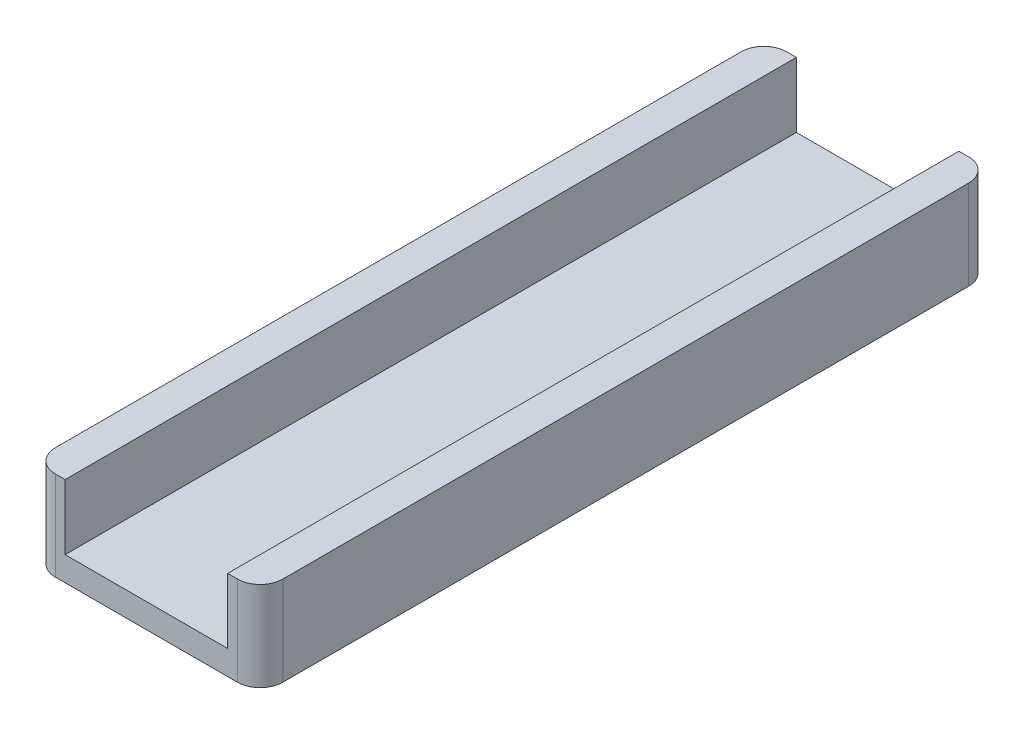
ISO-10303-21;
HEADER;
FILE_DESCRIPTION(('STEP AP214'),'2;1');
FILE_NAME('part.step','',(''),(''),'','','');
FILE_SCHEMA(('AUTOMOTIVE_DESIGN { 1 0 10303 214 1 1 1 1 }'));
ENDSEC;
DATA;
#1=APPLICATION_CONTEXT('core data for automotive mechanical design processes');
#2=APPLICATION_PROTOCOL_DEFINITION('international standard','automotive_design',2000,#1);
#3=PRODUCT_CONTEXT('',#1,'mechanical');
#4=PRODUCT('Part','Part','',(#3));
#5=PRODUCT_RELATED_PRODUCT_CATEGORY('part','',(#4));
#6=PRODUCT_DEFINITION_FORMATION('','',#4);
#7=PRODUCT_DEFINITION_CONTEXT('part definition',#1,'design');
#8=PRODUCT_DEFINITION('design','',#6,#7);
#9=PRODUCT_DEFINITION_SHAPE('','',#8);
#10=(LENGTH_UNIT() NAMED_UNIT(*) SI_UNIT(.MILLI.,.METRE.));
#11=(NAMED_UNIT(*) PLANE_ANGLE_UNIT() SI_UNIT($,.RADIAN.));
#12=(NAMED_UNIT(*) SI_UNIT($,.STERADIAN.) SOLID_ANGLE_UNIT());
#13=UNCERTAINTY_MEASURE_WITH_UNIT(LENGTH_MEASURE(1.E-05),#10,'distance_accuracy_value','');
#14=(GEOMETRIC_REPRESENTATION_CONTEXT(3) GLOBAL_UNCERTAINTY_ASSIGNED_CONTEXT((#13)) GLOBAL_UNIT_ASSIGNED_CONTEXT((#10,
#11,#12)) REPRESENTATION_CONTEXT('',''));
#15=CARTESIAN_POINT('',(0.,0.,0.));
#16=DIRECTION('',(0.,0.,1.));
#17=DIRECTION('',(1.,0.,0.));
#18=AXIS2_PLACEMENT_3D('',#15,#16,#17);
#19=CARTESIAN_POINT('',(0.,1.5,0.));
#20=DIRECTION('',(0.,-1.,0.));
#21=DIRECTION('',(0.,0.,-1.));
#22=AXIS2_PLACEMENT_3D('',#19,#20,#21);
#23=PLANE('',#22);
#24=DIRECTION('',(0.,0.,1.));
#25=VECTOR('',#24,1.);
#26=CARTESIAN_POINT('',(12.,1.5,-45.));
#27=LINE('',#26,#25);
#28=CARTESIAN_POINT('',(12.,1.5,-45.));
#29=VERTEX_POINT('',#28);
#30=CARTESIAN_POINT('',(12.,1.5,0.));
#31=VERTEX_POINT('',#30);
#32=EDGE_CURVE('E158',#29,#31,#27,.T.);
#33=ORIENTED_EDGE('',*,*,#32,.F.);
#34=DIRECTION('',(-1.,0.,0.));
#35=VECTOR('',#34,1.);
#36=CARTESIAN_POINT('',(0.,1.5,-45.));
#37=LINE('',#36,#35);
#38=CARTESIAN_POINT('',(2.,1.5,-45.));
#39=VERTEX_POINT('',#38);
#40=EDGE_CURVE('E143',#29,#39,#37,.T.);
#41=ORIENTED_EDGE('',*,*,#40,.T.);
#42=DIRECTION('',(0.,0.,-1.));
#43=VECTOR('',#42,1.);
#44=CARTESIAN_POINT('',(2.,1.5,-45.));
#45=LINE('',#44,#43);
#46=CARTESIAN_POINT('',(2.,1.5,0.));
#47=VERTEX_POINT('',#46);
#48=EDGE_CURVE('E147',#47,#39,#45,.T.);
#49=ORIENTED_EDGE('',*,*,#48,.F.);
#50=DIRECTION('',(1.,0.,0.));
#51=VECTOR('',#50,1.);
#52=CARTESIAN_POINT('',(0.,1.5,0.));
#53=LINE('',#52,#51);
#54=EDGE_CURVE('E177',#47,#31,#53,.T.);
#55=ORIENTED_EDGE('',*,*,#54,.T.);
#56=EDGE_LOOP('',(#33,#41,#49,#55));
#57=FACE_BOUND('',#56,.T.);
#58=ADVANCED_FACE('F35',(#57),#23,.F.);
#59=CARTESIAN_POINT('',(0.,1.5,0.));
#60=DIRECTION('',(1.,0.,0.));
#61=DIRECTION('',(0.,0.,-1.));
#62=AXIS2_PLACEMENT_3D('',#59,#60,#61);
#63=PLANE('',#62);
#64=DIRECTION('',(0.,0.,1.));
#65=VECTOR('',#64,1.);
#66=CARTESIAN_POINT('',(0.,0.,0.));
#67=LINE('',#66,#65);
#68=CARTESIAN_POINT('',(0.,0.,-43.6));
#69=VERTEX_POINT('',#68);
#70=CARTESIAN_POINT('',(0.,0.,-1.4));
#71=VERTEX_POINT('',#70);
#72=EDGE_CURVE('E176',#69,#71,#67,.T.);
#73=ORIENTED_EDGE('',*,*,#72,.T.);
#74=DIRECTION('',(0.,-1.,0.));
#75=VECTOR('',#74,1.);
#76=CARTESIAN_POINT('',(0.,1.5,-1.4));
#77=LINE('',#76,#75);
#78=CARTESIAN_POINT('',(0.,5.5,-1.40000000000001));
#79=VERTEX_POINT('',#78);
#80=EDGE_CURVE('E57',#71,#79,#77,.F.);
#81=ORIENTED_EDGE('',*,*,#80,.T.);
#82=DIRECTION('',(0.,0.,1.));
#83=VECTOR('',#82,1.);
#84=CARTESIAN_POINT('',(0.,5.5,-45.));
#85=LINE('',#84,#83);
#86=CARTESIAN_POINT('',(0.,5.5,-43.6));
#87=VERTEX_POINT('',#86);
#88=EDGE_CURVE('E161',#87,#79,#85,.T.);
#89=ORIENTED_EDGE('',*,*,#88,.F.);
#90=DIRECTION('',(0.,-1.,0.));
#91=VECTOR('',#90,1.);
#92=CARTESIAN_POINT('',(0.,1.5,-43.6));
#93=LINE('',#92,#91);
#94=EDGE_CURVE('E210',#87,#69,#93,.T.);
#95=ORIENTED_EDGE('',*,*,#94,.T.);
#96=EDGE_LOOP('',(#73,#81,#89,#95));
#97=FACE_BOUND('',#96,.T.);
#98=ADVANCED_FACE('F234',(#97),#63,.F.);
#99=CARTESIAN_POINT('',(0.,1.5,0.));
#100=DIRECTION('',(0.,0.,-1.));
#101=DIRECTION('',(-1.,0.,0.));
#102=AXIS2_PLACEMENT_3D('',#99,#100,#101);
#103=PLANE('',#102);
#104=DIRECTION('',(1.,0.,0.));
#105=VECTOR('',#104,1.);
#106=CARTESIAN_POINT('',(0.,0.,0.));
#107=LINE('',#106,#105);
#108=CARTESIAN_POINT('',(1.4,0.,0.));
#109=VERTEX_POINT('',#108);
#110=CARTESIAN_POINT('',(12.6,0.,0.));
#111=VERTEX_POINT('',#110);
#112=EDGE_CURVE('E183',#109,#111,#107,.T.);
#113=ORIENTED_EDGE('',*,*,#112,.T.);
#114=DIRECTION('',(0.,-1.,0.));
#115=VECTOR('',#114,1.);
#116=CARTESIAN_POINT('',(12.6,1.5,0.));
#117=LINE('',#116,#115);
#118=CARTESIAN_POINT('',(12.6,5.5,0.));
#119=VERTEX_POINT('',#118);
#120=EDGE_CURVE('E205',#111,#119,#117,.F.);
#121=ORIENTED_EDGE('',*,*,#120,.T.);
#122=DIRECTION('',(1.,0.,0.));
#123=VECTOR('',#122,1.);
#124=CARTESIAN_POINT('',(14.,5.5,0.));
#125=LINE('',#124,#123);
#126=CARTESIAN_POINT('',(12.,5.5,0.));
#127=VERTEX_POINT('',#126);
#128=EDGE_CURVE('E153',#127,#119,#125,.T.);
#129=ORIENTED_EDGE('',*,*,#128,.F.);
#130=DIRECTION('',(0.,-1.,0.));
#131=VECTOR('',#130,1.);
#132=CARTESIAN_POINT('',(12.,5.5,0.));
#133=LINE('',#132,#131);
#134=EDGE_CURVE('E148',#127,#31,#133,.T.);
#135=ORIENTED_EDGE('',*,*,#134,.T.);
#136=ORIENTED_EDGE('',*,*,#54,.F.);
#137=DIRECTION('',(0.,-1.,0.));
#138=VECTOR('',#137,1.);
#139=CARTESIAN_POINT('',(2.00000000000001,5.5,0.));
#140=LINE('',#139,#138);
#141=CARTESIAN_POINT('',(2.00000000000001,5.5,0.));
#142=VERTEX_POINT('',#141);
#143=EDGE_CURVE('E173',#142,#47,#140,.T.);
#144=ORIENTED_EDGE('',*,*,#143,.F.);
#145=DIRECTION('',(1.,0.,0.));
#146=VECTOR('',#145,1.);
#147=CARTESIAN_POINT('',(0.,5.5,0.));
#148=LINE('',#147,#146);
#149=CARTESIAN_POINT('',(1.4,5.5,0.));
#150=VERTEX_POINT('',#149);
#151=EDGE_CURVE('E163',#150,#142,#148,.T.);
#152=ORIENTED_EDGE('',*,*,#151,.F.);
#153=DIRECTION('',(0.,-1.,0.));
#154=VECTOR('',#153,1.);
#155=CARTESIAN_POINT('',(1.4,1.5,0.));
#156=LINE('',#155,#154);
#157=EDGE_CURVE('E202',#150,#109,#156,.T.);
#158=ORIENTED_EDGE('',*,*,#157,.T.);
#159=EDGE_LOOP('',(#113,#121,#129,#135,#136,#144,#152,#158));
#160=FACE_BOUND('',#159,.T.);
#161=ADVANCED_FACE('F225',(#160),#103,.F.);
#162=CARTESIAN_POINT('',(14.,1.5,0.));
#163=DIRECTION('',(-1.,0.,0.));
#164=DIRECTION('',(0.,0.,1.));
#165=AXIS2_PLACEMENT_3D('',#162,#163,#164);
#166=PLANE('',#165);
#167=DIRECTION('',(0.,0.,-1.));
#168=VECTOR('',#167,1.);
#169=CARTESIAN_POINT('',(14.,5.5,-45.));
#170=LINE('',#169,#168);
#171=CARTESIAN_POINT('',(14.,5.5,-1.40000000000001));
#172=VERTEX_POINT('',#171);
#173=CARTESIAN_POINT('',(14.,5.5,-43.6));
#174=VERTEX_POINT('',#173);
#175=EDGE_CURVE('E137',#172,#174,#170,.T.);
#176=ORIENTED_EDGE('',*,*,#175,.F.);
#177=DIRECTION('',(0.,-1.,0.));
#178=VECTOR('',#177,1.);
#179=CARTESIAN_POINT('',(14.,1.5,-1.4));
#180=LINE('',#179,#178);
#181=CARTESIAN_POINT('',(14.,0.,-1.4));
#182=VERTEX_POINT('',#181);
#183=EDGE_CURVE('E191',#172,#182,#180,.T.);
#184=ORIENTED_EDGE('',*,*,#183,.T.);
#185=DIRECTION('',(0.,0.,-1.));
#186=VECTOR('',#185,1.);
#187=CARTESIAN_POINT('',(14.,0.,0.));
#188=LINE('',#187,#186);
#189=CARTESIAN_POINT('',(14.,0.,-43.6));
#190=VERTEX_POINT('',#189);
#191=EDGE_CURVE('E186',#182,#190,#188,.T.);
#192=ORIENTED_EDGE('',*,*,#191,.T.);
#193=DIRECTION('',(0.,-1.,0.));
#194=VECTOR('',#193,1.);
#195=CARTESIAN_POINT('',(14.,1.5,-43.6));
#196=LINE('',#195,#194);
#197=EDGE_CURVE('E181',#190,#174,#196,.F.);
#198=ORIENTED_EDGE('',*,*,#197,.T.);
#199=EDGE_LOOP('',(#176,#184,#192,#198));
#200=FACE_BOUND('',#199,.T.);
#201=ADVANCED_FACE('F244',(#200),#166,.F.);
#202=CARTESIAN_POINT('',(0.,1.5,-45.));
#203=DIRECTION('',(0.,0.,1.));
#204=DIRECTION('',(1.,0.,0.));
#205=AXIS2_PLACEMENT_3D('',#202,#203,#204);
#206=PLANE('',#205);
#207=DIRECTION('',(-1.,0.,0.));
#208=VECTOR('',#207,1.);
#209=CARTESIAN_POINT('',(14.,5.5,-45.));
#210=LINE('',#209,#208);
#211=CARTESIAN_POINT('',(12.6,5.5,-45.));
#212=VERTEX_POINT('',#211);
#213=CARTESIAN_POINT('',(12.,5.5,-45.));
#214=VERTEX_POINT('',#213);
#215=EDGE_CURVE('E126',#212,#214,#210,.T.);
#216=ORIENTED_EDGE('',*,*,#215,.F.);
#217=DIRECTION('',(0.,-1.,0.));
#218=VECTOR('',#217,1.);
#219=CARTESIAN_POINT('',(12.6,1.5,-45.));
#220=LINE('',#219,#218);
#221=CARTESIAN_POINT('',(12.6,0.,-45.));
#222=VERTEX_POINT('',#221);
#223=EDGE_CURVE('E11',#212,#222,#220,.T.);
#224=ORIENTED_EDGE('',*,*,#223,.T.);
#225=DIRECTION('',(-1.,0.,0.));
#226=VECTOR('',#225,1.);
#227=CARTESIAN_POINT('',(0.,0.,-45.));
#228=LINE('',#227,#226);
#229=CARTESIAN_POINT('',(1.4,0.,-45.));
#230=VERTEX_POINT('',#229);
#231=EDGE_CURVE('E179',#222,#230,#228,.T.);
#232=ORIENTED_EDGE('',*,*,#231,.T.);
#233=DIRECTION('',(0.,-1.,0.));
#234=VECTOR('',#233,1.);
#235=CARTESIAN_POINT('',(1.4,1.5,-45.));
#236=LINE('',#235,#234);
#237=CARTESIAN_POINT('',(1.4,5.5,-45.));
#238=VERTEX_POINT('',#237);
#239=EDGE_CURVE('E43',#230,#238,#236,.F.);
#240=ORIENTED_EDGE('',*,*,#239,.T.);
#241=DIRECTION('',(-1.,0.,0.));
#242=VECTOR('',#241,1.);
#243=CARTESIAN_POINT('',(0.,5.5,-45.));
#244=LINE('',#243,#242);
#245=CARTESIAN_POINT('',(2.,5.5,-45.));
#246=VERTEX_POINT('',#245);
#247=EDGE_CURVE('E167',#246,#238,#244,.T.);
#248=ORIENTED_EDGE('',*,*,#247,.F.);
#249=DIRECTION('',(0.,-1.,0.));
#250=VECTOR('',#249,1.);
#251=CARTESIAN_POINT('',(2.,5.5,-45.));
#252=LINE('',#251,#250);
#253=EDGE_CURVE('E169',#246,#39,#252,.T.);
#254=ORIENTED_EDGE('',*,*,#253,.T.);
#255=ORIENTED_EDGE('',*,*,#40,.F.);
#256=DIRECTION('',(0.,-1.,0.));
#257=VECTOR('',#256,1.);
#258=CARTESIAN_POINT('',(12.,5.5,-45.));
#259=LINE('',#258,#257);
#260=EDGE_CURVE('E140',#214,#29,#259,.T.);
#261=ORIENTED_EDGE('',*,*,#260,.F.);
#262=EDGE_LOOP('',(#216,#224,#232,#240,#248,#254,#255,#261));
#263=FACE_BOUND('',#262,.T.);
#264=ADVANCED_FACE('F141',(#263),#206,.F.);
#265=CARTESIAN_POINT('',(0.,0.,0.));
#266=DIRECTION('',(0.,-1.,0.));
#267=DIRECTION('',(0.,0.,-1.));
#268=AXIS2_PLACEMENT_3D('',#265,#266,#267);
#269=PLANE('',#268);
#270=ORIENTED_EDGE('',*,*,#191,.F.);
#271=CARTESIAN_POINT('',(12.6,0.,-1.4));
#272=DIRECTION('',(0.,-1.,0.));
#273=DIRECTION('',(0.,0.,-1.));
#274=AXIS2_PLACEMENT_3D('',#271,#272,#273);
#275=CIRCLE('',#274,1.4);
#276=EDGE_CURVE('E200',#182,#111,#275,.T.);
#277=ORIENTED_EDGE('',*,*,#276,.T.);
#278=ORIENTED_EDGE('',*,*,#112,.F.);
#279=CARTESIAN_POINT('',(1.4,0.,-1.4));
#280=DIRECTION('',(0.,-1.,0.));
#281=DIRECTION('',(0.,0.,-1.));
#282=AXIS2_PLACEMENT_3D('',#279,#280,#281);
#283=CIRCLE('',#282,1.4);
#284=EDGE_CURVE('E198',#109,#71,#283,.T.);
#285=ORIENTED_EDGE('',*,*,#284,.T.);
#286=ORIENTED_EDGE('',*,*,#72,.F.);
#287=CARTESIAN_POINT('',(1.4,0.,-43.6));
#288=DIRECTION('',(0.,-1.,0.));
#289=DIRECTION('',(0.,0.,-1.));
#290=AXIS2_PLACEMENT_3D('',#287,#288,#289);
#291=CIRCLE('',#290,1.4);
#292=EDGE_CURVE('E194',#69,#230,#291,.T.);
#293=ORIENTED_EDGE('',*,*,#292,.T.);
#294=ORIENTED_EDGE('',*,*,#231,.F.);
#295=CARTESIAN_POINT('',(12.6,0.,-43.6));
#296=DIRECTION('',(0.,-1.,0.));
#297=DIRECTION('',(0.,0.,-1.));
#298=AXIS2_PLACEMENT_3D('',#295,#296,#297);
#299=CIRCLE('',#298,1.4);
#300=EDGE_CURVE('E196',#222,#190,#299,.T.);
#301=ORIENTED_EDGE('',*,*,#300,.T.);
#302=EDGE_LOOP('',(#270,#277,#278,#285,#286,#293,#294,#301));
#303=FACE_BOUND('',#302,.T.);
#304=ADVANCED_FACE('F233',(#303),#269,.T.);
#305=CARTESIAN_POINT('',(2.,5.5,-45.));
#306=DIRECTION('',(-1.,0.,0.));
#307=DIRECTION('',(0.,0.,1.));
#308=AXIS2_PLACEMENT_3D('',#305,#306,#307);
#309=PLANE('',#308);
#310=ORIENTED_EDGE('',*,*,#48,.T.);
#311=ORIENTED_EDGE('',*,*,#253,.F.);
#312=DIRECTION('',(0.,0.,-1.));
#313=VECTOR('',#312,1.);
#314=CARTESIAN_POINT('',(2.,5.5,-45.));
#315=LINE('',#314,#313);
#316=EDGE_CURVE('E165',#142,#246,#315,.T.);
#317=ORIENTED_EDGE('',*,*,#316,.F.);
#318=ORIENTED_EDGE('',*,*,#143,.T.);
#319=EDGE_LOOP('',(#310,#311,#317,#318));
#320=FACE_BOUND('',#319,.T.);
#321=ADVANCED_FACE('F252',(#320),#309,.F.);
#322=CARTESIAN_POINT('',(0.,5.5,0.));
#323=DIRECTION('',(0.,1.,0.));
#324=DIRECTION('',(0.,0.,1.));
#325=AXIS2_PLACEMENT_3D('',#322,#323,#324);
#326=PLANE('',#325);
#327=ORIENTED_EDGE('',*,*,#88,.T.);
#328=CARTESIAN_POINT('',(1.4,5.5,-1.4));
#329=DIRECTION('',(0.,1.,0.));
#330=DIRECTION('',(0.,0.,1.));
#331=AXIS2_PLACEMENT_3D('',#328,#329,#330);
#332=CIRCLE('',#331,1.4);
#333=EDGE_CURVE('E216',#79,#150,#332,.T.);
#334=ORIENTED_EDGE('',*,*,#333,.T.);
#335=ORIENTED_EDGE('',*,*,#151,.T.);
#336=ORIENTED_EDGE('',*,*,#316,.T.);
#337=ORIENTED_EDGE('',*,*,#247,.T.);
#338=CARTESIAN_POINT('',(1.4,5.5,-43.6));
#339=DIRECTION('',(0.,1.,0.));
#340=DIRECTION('',(0.,0.,1.));
#341=AXIS2_PLACEMENT_3D('',#338,#339,#340);
#342=CIRCLE('',#341,1.4);
#343=EDGE_CURVE('E214',#238,#87,#342,.T.);
#344=ORIENTED_EDGE('',*,*,#343,.T.);
#345=EDGE_LOOP('',(#327,#334,#335,#336,#337,#344));
#346=FACE_BOUND('',#345,.T.);
#347=ADVANCED_FACE('F220',(#346),#326,.T.);
#348=CARTESIAN_POINT('',(12.,5.5,-45.));
#349=DIRECTION('',(1.,0.,0.));
#350=DIRECTION('',(0.,0.,-1.));
#351=AXIS2_PLACEMENT_3D('',#348,#349,#350);
#352=PLANE('',#351);
#353=ORIENTED_EDGE('',*,*,#32,.T.);
#354=ORIENTED_EDGE('',*,*,#134,.F.);
#355=DIRECTION('',(0.,0.,1.));
#356=VECTOR('',#355,1.);
#357=CARTESIAN_POINT('',(12.,5.5,-45.));
#358=LINE('',#357,#356);
#359=EDGE_CURVE('E131',#214,#127,#358,.T.);
#360=ORIENTED_EDGE('',*,*,#359,.F.);
#361=ORIENTED_EDGE('',*,*,#260,.T.);
#362=EDGE_LOOP('',(#353,#354,#360,#361));
#363=FACE_BOUND('',#362,.T.);
#364=ADVANCED_FACE('F150',(#363),#352,.F.);
#365=CARTESIAN_POINT('',(0.,5.5,0.));
#366=DIRECTION('',(0.,-1.,0.));
#367=DIRECTION('',(0.,0.,-1.));
#368=AXIS2_PLACEMENT_3D('',#365,#366,#367);
#369=PLANE('',#368);
#370=ORIENTED_EDGE('',*,*,#128,.T.);
#371=CARTESIAN_POINT('',(12.6,5.5,-1.4));
#372=DIRECTION('',(0.,-1.,0.));
#373=DIRECTION('',(0.,0.,-1.));
#374=AXIS2_PLACEMENT_3D('',#371,#372,#373);
#375=CIRCLE('',#374,1.4);
#376=EDGE_CURVE('E208',#119,#172,#375,.F.);
#377=ORIENTED_EDGE('',*,*,#376,.T.);
#378=ORIENTED_EDGE('',*,*,#175,.T.);
#379=CARTESIAN_POINT('',(12.6,5.5,-43.6));
#380=DIRECTION('',(0.,-1.,0.));
#381=DIRECTION('',(0.,0.,-1.));
#382=AXIS2_PLACEMENT_3D('',#379,#380,#381);
#383=CIRCLE('',#382,1.4);
#384=EDGE_CURVE('E135',#174,#212,#383,.F.);
#385=ORIENTED_EDGE('',*,*,#384,.T.);
#386=ORIENTED_EDGE('',*,*,#215,.T.);
#387=ORIENTED_EDGE('',*,*,#359,.T.);
#388=EDGE_LOOP('',(#370,#377,#378,#385,#386,#387));
#389=FACE_BOUND('',#388,.T.);
#390=ADVANCED_FACE('F129',(#389),#369,.F.);
#391=CARTESIAN_POINT('',(12.6,1.5,-1.4));
#392=DIRECTION('',(0.,-1.,0.));
#393=DIRECTION('',(0.,0.,-1.));
#394=AXIS2_PLACEMENT_3D('',#391,#392,#393);
#395=CYLINDRICAL_SURFACE('',#394,1.4);
#396=ORIENTED_EDGE('',*,*,#376,.F.);
#397=ORIENTED_EDGE('',*,*,#120,.F.);
#398=ORIENTED_EDGE('',*,*,#276,.F.);
#399=ORIENTED_EDGE('',*,*,#183,.F.);
#400=EDGE_LOOP('',(#396,#397,#398,#399));
#401=FACE_BOUND('',#400,.T.);
#402=ADVANCED_FACE('F248',(#401),#395,.T.);
#403=CARTESIAN_POINT('',(1.4,1.5,-1.4));
#404=DIRECTION('',(0.,-1.,0.));
#405=DIRECTION('',(0.,0.,-1.));
#406=AXIS2_PLACEMENT_3D('',#403,#404,#405);
#407=CYLINDRICAL_SURFACE('',#406,1.4);
#408=ORIENTED_EDGE('',*,*,#333,.F.);
#409=ORIENTED_EDGE('',*,*,#80,.F.);
#410=ORIENTED_EDGE('',*,*,#284,.F.);
#411=ORIENTED_EDGE('',*,*,#157,.F.);
#412=EDGE_LOOP('',(#408,#409,#410,#411));
#413=FACE_BOUND('',#412,.T.);
#414=ADVANCED_FACE('F229',(#413),#407,.T.);
#415=CARTESIAN_POINT('',(12.6,1.5,-43.6));
#416=DIRECTION('',(0.,-1.,0.));
#417=DIRECTION('',(0.,0.,-1.));
#418=AXIS2_PLACEMENT_3D('',#415,#416,#417);
#419=CYLINDRICAL_SURFACE('',#418,1.4);
#420=ORIENTED_EDGE('',*,*,#384,.F.);
#421=ORIENTED_EDGE('',*,*,#197,.F.);
#422=ORIENTED_EDGE('',*,*,#300,.F.);
#423=ORIENTED_EDGE('',*,*,#223,.F.);
#424=EDGE_LOOP('',(#420,#421,#422,#423));
#425=FACE_BOUND('',#424,.T.);
#426=ADVANCED_FACE('F240',(#425),#419,.T.);
#427=CARTESIAN_POINT('',(1.4,1.5,-43.6));
#428=DIRECTION('',(0.,-1.,0.));
#429=DIRECTION('',(0.,0.,-1.));
#430=AXIS2_PLACEMENT_3D('',#427,#428,#429);
#431=CYLINDRICAL_SURFACE('',#430,1.4);
#432=ORIENTED_EDGE('',*,*,#343,.F.);
#433=ORIENTED_EDGE('',*,*,#239,.F.);
#434=ORIENTED_EDGE('',*,*,#292,.F.);
#435=ORIENTED_EDGE('',*,*,#94,.F.);
#436=EDGE_LOOP('',(#432,#433,#434,#435));
#437=FACE_BOUND('',#436,.T.);
#438=ADVANCED_FACE('F37',(#437),#431,.T.);
#439=CLOSED_SHELL('',(#58,#98,#161,#201,#264,#304,#321,#347,#364,#390,#402,#414,#426,#438));
#440=MANIFOLD_SOLID_BREP('B2',#439);
#441=ADVANCED_BREP_SHAPE_REPRESENTATION('',(#18,#440),#14);
#442=SHAPE_DEFINITION_REPRESENTATION(#9,#441);
ENDSEC;
END-ISO-10303-21;
